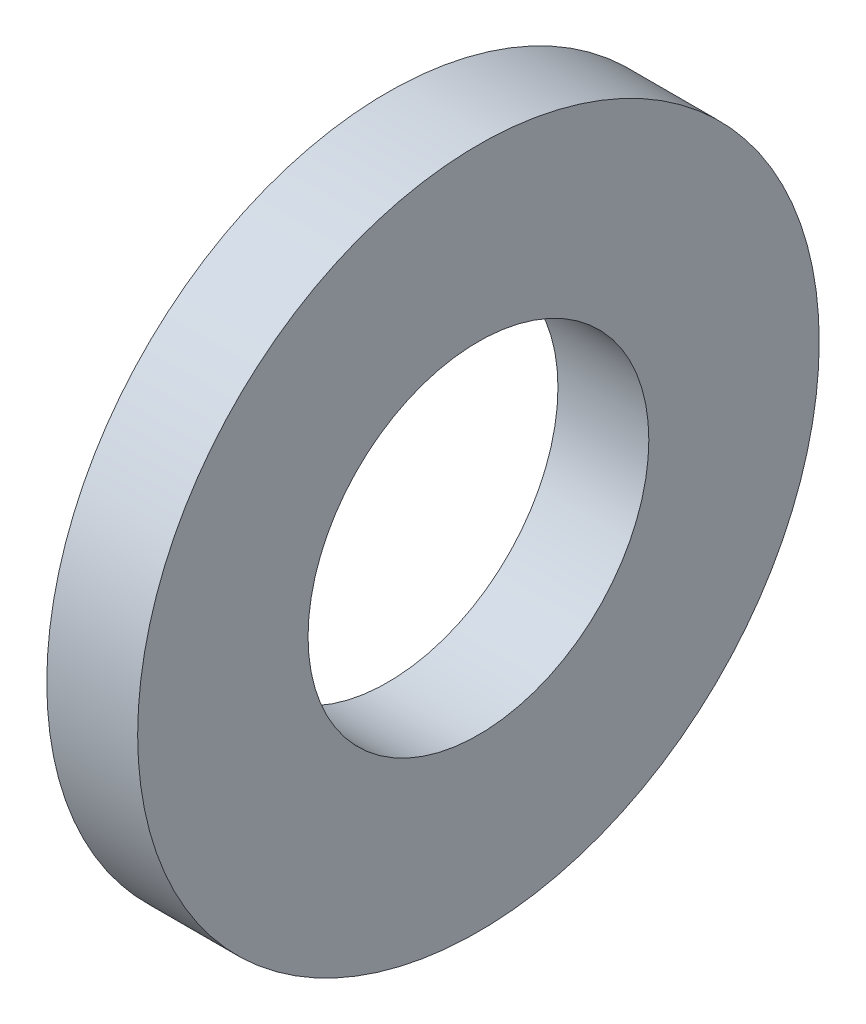
ISO-10303-21;
HEADER;
FILE_DESCRIPTION(('STEP AP214'),'2;1');
FILE_NAME('part.step','',(''),(''),'','','');
FILE_SCHEMA(('AUTOMOTIVE_DESIGN { 1 0 10303 214 1 1 1 1 }'));
ENDSEC;
DATA;
#1=APPLICATION_CONTEXT('core data for automotive mechanical design processes');
#2=APPLICATION_PROTOCOL_DEFINITION('international standard','automotive_design',2000,#1);
#3=PRODUCT_CONTEXT('',#1,'mechanical');
#4=PRODUCT('Part','Part','',(#3));
#5=PRODUCT_RELATED_PRODUCT_CATEGORY('part','',(#4));
#6=PRODUCT_DEFINITION_FORMATION('','',#4);
#7=PRODUCT_DEFINITION_CONTEXT('part definition',#1,'design');
#8=PRODUCT_DEFINITION('design','',#6,#7);
#9=PRODUCT_DEFINITION_SHAPE('','',#8);
#10=(LENGTH_UNIT() NAMED_UNIT(*) SI_UNIT(.MILLI.,.METRE.));
#11=(NAMED_UNIT(*) PLANE_ANGLE_UNIT() SI_UNIT($,.RADIAN.));
#12=(NAMED_UNIT(*) SI_UNIT($,.STERADIAN.) SOLID_ANGLE_UNIT());
#13=UNCERTAINTY_MEASURE_WITH_UNIT(LENGTH_MEASURE(1.E-05),#10,'distance_accuracy_value','');
#14=(GEOMETRIC_REPRESENTATION_CONTEXT(3) GLOBAL_UNCERTAINTY_ASSIGNED_CONTEXT((#13)) GLOBAL_UNIT_ASSIGNED_CONTEXT((#10,
#11,#12)) REPRESENTATION_CONTEXT('',''));
#15=CARTESIAN_POINT('',(0.,0.,0.));
#16=DIRECTION('',(0.,0.,1.));
#17=DIRECTION('',(1.,0.,0.));
#18=AXIS2_PLACEMENT_3D('',#15,#16,#17);
#19=CARTESIAN_POINT('',(-16.706392,3.75,0.));
#20=DIRECTION('',(1.,0.,0.));
#21=DIRECTION('',(0.,0.,-1.));
#22=AXIS2_PLACEMENT_3D('',#19,#20,#21);
#23=PLANE('',#22);
#24=CARTESIAN_POINT('',(-16.706392,0.,0.));
#25=DIRECTION('',(-1.,0.,0.));
#26=DIRECTION('',(0.,0.,1.));
#27=AXIS2_PLACEMENT_3D('',#24,#25,#26);
#28=CIRCLE('',#27,3.75);
#29=CARTESIAN_POINT('',(-16.706392,0.,3.75));
#30=VERTEX_POINT('',#29);
#31=EDGE_CURVE('E45',#30,#30,#28,.T.);
#32=ORIENTED_EDGE('',*,*,#31,.F.);
#33=EDGE_LOOP('',(#32));
#34=FACE_BOUND('',#33,.T.);
#35=CARTESIAN_POINT('',(-16.706392,0.,0.));
#36=DIRECTION('',(-1.,0.,0.));
#37=DIRECTION('',(0.,0.,1.));
#38=AXIS2_PLACEMENT_3D('',#35,#36,#37);
#39=CIRCLE('',#38,7.5);
#40=CARTESIAN_POINT('',(-16.706392,0.,7.5));
#41=VERTEX_POINT('',#40);
#42=EDGE_CURVE('E10',#41,#41,#39,.T.);
#43=ORIENTED_EDGE('',*,*,#42,.T.);
#44=EDGE_LOOP('',(#43));
#45=FACE_BOUND('',#44,.T.);
#46=ADVANCED_FACE('F31',(#34,#45),#23,.F.);
#47=CARTESIAN_POINT('',(-42.6301030927835,0.,0.));
#48=DIRECTION('',(-1.,0.,0.));
#49=DIRECTION('',(0.,0.,1.));
#50=AXIS2_PLACEMENT_3D('',#47,#48,#49);
#51=CYLINDRICAL_SURFACE('',#50,7.5);
#52=ORIENTED_EDGE('',*,*,#42,.F.);
#53=EDGE_LOOP('',(#52));
#54=FACE_BOUND('',#53,.T.);
#55=CARTESIAN_POINT('',(-14.706392,0.,0.));
#56=DIRECTION('',(-1.,0.,0.));
#57=DIRECTION('',(0.,0.,1.));
#58=AXIS2_PLACEMENT_3D('',#55,#56,#57);
#59=CIRCLE('',#58,7.5);
#60=CARTESIAN_POINT('',(-14.706392,0.,7.5));
#61=VERTEX_POINT('',#60);
#62=EDGE_CURVE('E37',#61,#61,#59,.T.);
#63=ORIENTED_EDGE('',*,*,#62,.T.);
#64=EDGE_LOOP('',(#63));
#65=FACE_BOUND('',#64,.T.);
#66=ADVANCED_FACE('F54',(#54,#65),#51,.T.);
#67=CARTESIAN_POINT('',(-14.706392,7.5,0.));
#68=DIRECTION('',(-1.,0.,0.));
#69=DIRECTION('',(0.,0.,1.));
#70=AXIS2_PLACEMENT_3D('',#67,#68,#69);
#71=PLANE('',#70);
#72=ORIENTED_EDGE('',*,*,#62,.F.);
#73=EDGE_LOOP('',(#72));
#74=FACE_BOUND('',#73,.T.);
#75=CARTESIAN_POINT('',(-14.706392,0.,0.));
#76=DIRECTION('',(-1.,0.,0.));
#77=DIRECTION('',(0.,0.,1.));
#78=AXIS2_PLACEMENT_3D('',#75,#76,#77);
#79=CIRCLE('',#78,3.75);
#80=CARTESIAN_POINT('',(-14.706392,0.,3.75));
#81=VERTEX_POINT('',#80);
#82=EDGE_CURVE('E41',#81,#81,#79,.T.);
#83=ORIENTED_EDGE('',*,*,#82,.T.);
#84=EDGE_LOOP('',(#83));
#85=FACE_BOUND('',#84,.T.);
#86=ADVANCED_FACE('F58',(#74,#85),#71,.F.);
#87=CARTESIAN_POINT('',(-42.6301030927835,0.,0.));
#88=DIRECTION('',(-1.,0.,0.));
#89=DIRECTION('',(0.,0.,1.));
#90=AXIS2_PLACEMENT_3D('',#87,#88,#89);
#91=CYLINDRICAL_SURFACE('',#90,3.75);
#92=ORIENTED_EDGE('',*,*,#82,.F.);
#93=EDGE_LOOP('',(#92));
#94=FACE_BOUND('',#93,.T.);
#95=ORIENTED_EDGE('',*,*,#31,.T.);
#96=EDGE_LOOP('',(#95));
#97=FACE_BOUND('',#96,.T.);
#98=ADVANCED_FACE('F51',(#94,#97),#91,.F.);
#99=CLOSED_SHELL('',(#46,#66,#86,#98));
#100=MANIFOLD_SOLID_BREP('B2',#99);
#101=ADVANCED_BREP_SHAPE_REPRESENTATION('',(#18,#100),#14);
#102=SHAPE_DEFINITION_REPRESENTATION(#9,#101);
ENDSEC;
END-ISO-10303-21;
